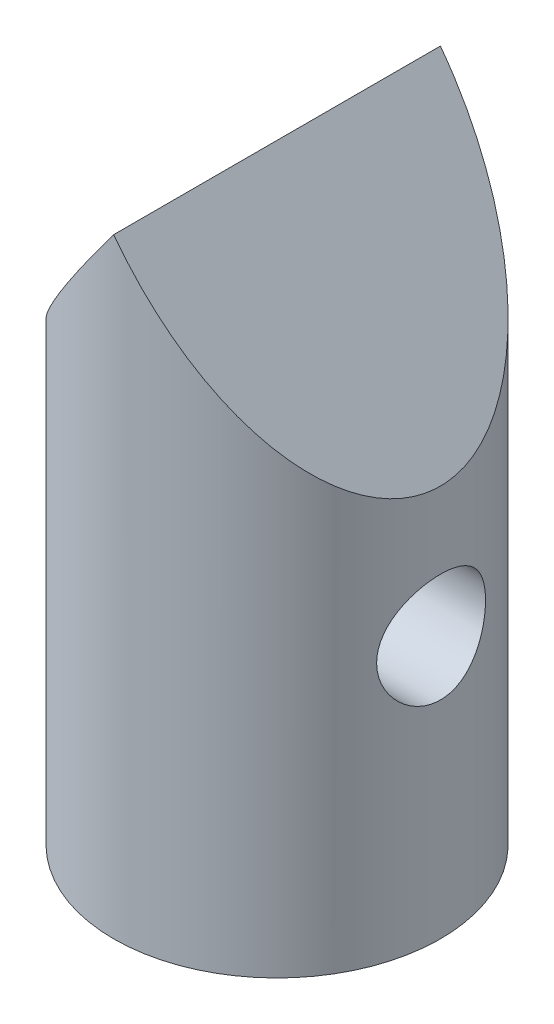
ISO-10303-21;
HEADER;
FILE_DESCRIPTION(('STEP AP214'),'2;1');
FILE_NAME('part.step','',(''),(''),'','','');
FILE_SCHEMA(('AUTOMOTIVE_DESIGN { 1 0 10303 214 1 1 1 1 }'));
ENDSEC;
DATA;
#1=APPLICATION_CONTEXT('core data for automotive mechanical design processes');
#2=APPLICATION_PROTOCOL_DEFINITION('international standard','automotive_design',2000,#1);
#3=PRODUCT_CONTEXT('',#1,'mechanical');
#4=PRODUCT('Part','Part','',(#3));
#5=PRODUCT_RELATED_PRODUCT_CATEGORY('part','',(#4));
#6=PRODUCT_DEFINITION_FORMATION('','',#4);
#7=PRODUCT_DEFINITION_CONTEXT('part definition',#1,'design');
#8=PRODUCT_DEFINITION('design','',#6,#7);
#9=PRODUCT_DEFINITION_SHAPE('','',#8);
#10=(LENGTH_UNIT() NAMED_UNIT(*) SI_UNIT(.MILLI.,.METRE.));
#11=(NAMED_UNIT(*) PLANE_ANGLE_UNIT() SI_UNIT($,.RADIAN.));
#12=(NAMED_UNIT(*) SI_UNIT($,.STERADIAN.) SOLID_ANGLE_UNIT());
#13=UNCERTAINTY_MEASURE_WITH_UNIT(LENGTH_MEASURE(1.E-05),#10,'distance_accuracy_value','');
#14=(GEOMETRIC_REPRESENTATION_CONTEXT(3) GLOBAL_UNCERTAINTY_ASSIGNED_CONTEXT((#13)) GLOBAL_UNIT_ASSIGNED_CONTEXT((#10,
#11,#12)) REPRESENTATION_CONTEXT('',''));
#15=CARTESIAN_POINT('',(0.,0.,0.));
#16=DIRECTION('',(0.,0.,1.));
#17=DIRECTION('',(1.,0.,0.));
#18=AXIS2_PLACEMENT_3D('',#15,#16,#17);
#19=CARTESIAN_POINT('',(0.,17.78,0.));
#20=DIRECTION('',(0.,-1.,0.));
#21=DIRECTION('',(0.,0.,-1.));
#22=AXIS2_PLACEMENT_3D('',#19,#20,#21);
#23=CYLINDRICAL_SURFACE('',#22,4.7625);
#24=CARTESIAN_POINT('',(0.,0.,0.));
#25=DIRECTION('',(0.,1.,0.));
#26=DIRECTION('',(0.,0.,1.));
#27=AXIS2_PLACEMENT_3D('',#24,#25,#26);
#28=CIRCLE('',#27,4.7625);
#29=CARTESIAN_POINT('',(0.,0.,4.7625));
#30=VERTEX_POINT('',#29);
#31=EDGE_CURVE('E45',#30,#30,#28,.T.);
#32=ORIENTED_EDGE('',*,*,#31,.T.);
#33=EDGE_LOOP('',(#32));
#34=FACE_BOUND('',#33,.T.);
#35=CARTESIAN_POINT('',(0.,17.78,0.));
#36=DIRECTION('',(0.8,0.6,0.));
#37=DIRECTION('',(0.6,-0.8,0.));
#38=AXIS2_PLACEMENT_3D('',#35,#36,#37);
#39=ELLIPSE('',#38,7.9375,4.7625);
#40=CARTESIAN_POINT('',(0.,17.78,4.7625));
#41=VERTEX_POINT('',#40);
#42=CARTESIAN_POINT('',(0.,17.78,-4.7625));
#43=VERTEX_POINT('',#42);
#44=EDGE_CURVE('E51',#41,#43,#39,.T.);
#45=ORIENTED_EDGE('',*,*,#44,.F.);
#46=CARTESIAN_POINT('',(0.,17.78,0.));
#47=DIRECTION('',(-0.8,0.6,0.));
#48=DIRECTION('',(-0.6,-0.8,0.));
#49=AXIS2_PLACEMENT_3D('',#46,#47,#48);
#50=ELLIPSE('',#49,7.9375,4.7625);
#51=EDGE_CURVE('E56',#43,#41,#50,.T.);
#52=ORIENTED_EDGE('',*,*,#51,.F.);
#53=EDGE_LOOP('',(#45,#52));
#54=FACE_BOUND('',#53,.T.);
#55=CARTESIAN_POINT('',(-4.49012806053458,7.62,1.5875));
#56=CARTESIAN_POINT('',(-4.49012777567064,7.70646822755226,1.58750040949199));
#57=CARTESIAN_POINT('',(-4.49265308749236,7.79293399471995,1.58041146910077));
#58=CARTESIAN_POINT('',(-4.50242898853992,7.96330389332837,1.55233867155598));
#59=CARTESIAN_POINT('',(-4.50968035613225,8.04720760042254,1.53135252556733));
#60=CARTESIAN_POINT('',(-4.52799773355957,8.20995769263319,1.47630433352479));
#61=CARTESIAN_POINT('',(-4.53905626304473,8.28881363799031,1.44226791397765));
#62=CARTESIAN_POINT('',(-4.5637310619139,8.43972157706989,1.36217283515069));
#63=CARTESIAN_POINT('',(-4.57734789544485,8.51177206480389,1.31611152331554));
#64=CARTESIAN_POINT('',(-4.60620251934364,8.64984294021207,1.21134369497807));
#65=CARTESIAN_POINT('',(-4.62148070565872,8.71555824301637,1.15224614193745));
#66=CARTESIAN_POINT('',(-4.65159510371592,8.83635329694411,1.02391792170285));
#67=CARTESIAN_POINT('',(-4.66643124415977,8.89143134013701,0.954685630395646));
#68=CARTESIAN_POINT('',(-4.69445763738356,8.99077274951073,0.805822156394453));
#69=CARTESIAN_POINT('',(-4.70759484726299,9.03471645335601,0.725966784068934));
#70=CARTESIAN_POINT('',(-4.73026718998935,9.10842664138992,0.559484566492615));
#71=CARTESIAN_POINT('',(-4.73980329347265,9.13819694641834,0.472859553528449));
#72=CARTESIAN_POINT('',(-4.75391282248152,9.18168066922892,0.298495747675672));
#73=CARTESIAN_POINT('',(-4.75864737209377,9.195916720933,0.210900573329086));
#74=CARTESIAN_POINT('',(-4.76319228046466,9.20958961571005,0.034445376283244));
#75=CARTESIAN_POINT('',(-4.76300390842339,9.20903027324821,-0.0544143145009298));
#76=CARTESIAN_POINT('',(-4.75783337894744,9.19345974587642,-0.227176830370185));
#77=CARTESIAN_POINT('',(-4.75303952798777,9.17901623604672,-0.311137377139271));
#78=CARTESIAN_POINT('',(-4.73943310651795,9.13702614269353,-0.475366459130179));
#79=CARTESIAN_POINT('',(-4.73062026364395,9.10947867111964,-0.555634743724441));
#80=CARTESIAN_POINT('',(-4.70972626590601,9.04173115877652,-0.711442053811696));
#81=CARTESIAN_POINT('',(-4.69760367507278,9.00136957255699,-0.786905050788285));
#82=CARTESIAN_POINT('',(-4.67135198948881,8.90927271760068,-0.930154866774382));
#83=CARTESIAN_POINT('',(-4.65722233718322,8.85753428621896,-0.997939543335821));
#84=CARTESIAN_POINT('',(-4.62766079563288,8.74129190038108,-1.12728512565115));
#85=CARTESIAN_POINT('',(-4.61219891586608,8.67630161192036,-1.18840274934474));
#86=CARTESIAN_POINT('',(-4.58227644701614,8.53686264791528,-1.29901514960847));
#87=CARTESIAN_POINT('',(-4.56781601248676,8.46241251743024,-1.34850813494589));
#88=CARTESIAN_POINT('',(-4.54136958652655,8.30476236933553,-1.43508008488034));
#89=CARTESIAN_POINT('',(-4.52942181075379,8.2214527414536,-1.47197201104604));
#90=CARTESIAN_POINT('',(-4.509796207693,8.04930541160231,-1.53105356936297));
#91=CARTESIAN_POINT('',(-4.50211659108192,7.96047004356035,-1.5532493632619));
#92=CARTESIAN_POINT('',(-4.49230172629537,7.78408661080152,-1.58140603531863));
#93=CARTESIAN_POINT('',(-4.48993197000283,7.69666128821616,-1.58805418911537));
#94=CARTESIAN_POINT('',(-4.49034966899696,7.5219303632767,-1.58687363427217));
#95=CARTESIAN_POINT('',(-4.49313618758519,7.43462474206069,-1.57904755504828));
#96=CARTESIAN_POINT('',(-4.50331868716889,7.26573831693353,-1.54975822183853));
#97=CARTESIAN_POINT('',(-4.51055304136942,7.18406387963586,-1.52877265044413));
#98=CARTESIAN_POINT('',(-4.52863828953141,7.02541202509498,-1.47433325681495));
#99=CARTESIAN_POINT('',(-4.53948982459164,6.94843544334955,-1.44087722422699));
#100=CARTESIAN_POINT('',(-4.56401293183202,6.79865858190548,-1.36124051592301));
#101=CARTESIAN_POINT('',(-4.57776303244155,6.72606820480616,-1.3146899003941));
#102=CARTESIAN_POINT('',(-4.60638157860437,6.58948064184082,-1.21060468851014));
#103=CARTESIAN_POINT('',(-4.62125035304532,6.52548599862531,-1.15306685422932));
#104=CARTESIAN_POINT('',(-4.65129623837577,6.40472432525612,-1.02535308311676));
#105=CARTESIAN_POINT('',(-4.66645376679908,6.34845315584508,-0.95470229199281));
#106=CARTESIAN_POINT('',(-4.69466376935812,6.24853312402248,-0.80458832509791));
#107=CARTESIAN_POINT('',(-4.70771631825591,6.20488381327965,-0.725125462472478));
#108=CARTESIAN_POINT('',(-4.73018494224332,6.13184558353203,-0.56003803161127));
#109=CARTESIAN_POINT('',(-4.73962460132193,6.10236384752745,-0.4744579082724));
#110=CARTESIAN_POINT('',(-4.75390544704967,6.05833220947958,-0.299177814530552));
#111=CARTESIAN_POINT('',(-4.75874829354005,6.0437769175647,-0.2094793434768));
#112=CARTESIAN_POINT('',(-4.76316457887557,6.03049645180104,-0.033044345677816));
#113=CARTESIAN_POINT('',(-4.76297498141985,6.03105941688235,0.0536332492230283));
#114=CARTESIAN_POINT('',(-4.75793111974544,6.04624347668242,0.225601442687775));
#115=CARTESIAN_POINT('',(-4.75307723394552,6.06086343094252,0.310892153200252));
#116=CARTESIAN_POINT('',(-4.7393370249013,6.10327429738934,0.476316864598393));
#117=CARTESIAN_POINT('',(-4.73051597648323,6.13085231687278,0.556511255074052));
#118=CARTESIAN_POINT('',(-4.70974992618386,6.19819933061673,0.711165632116924));
#119=CARTESIAN_POINT('',(-4.69780435926226,6.23797053012526,0.78562457832611));
#120=CARTESIAN_POINT('',(-4.67147066764261,6.33026660046194,0.929694000890196));
#121=CARTESIAN_POINT('',(-4.65700860080933,6.38320841304335,0.999023674347701));
#122=CARTESIAN_POINT('',(-4.62745119707109,6.49963360846046,1.12804737920748));
#123=CARTESIAN_POINT('',(-4.61235565927292,6.56312035459208,1.18773832432904));
#124=CARTESIAN_POINT('',(-4.58252956723137,6.70180485199428,1.29816512152257));
#125=CARTESIAN_POINT('',(-4.56783643181951,6.77736374867541,1.34845895852167));
#126=CARTESIAN_POINT('',(-4.54120556900287,6.93631840270816,1.43559901999052));
#127=CARTESIAN_POINT('',(-4.52926712193483,7.01971210518459,1.47244875820092));
#128=CARTESIAN_POINT('',(-4.51010868052842,7.18813939562481,1.53010207727411));
#129=CARTESIAN_POINT('',(-4.50269979660777,7.27292846834652,1.55155568077486));
#130=CARTESIAN_POINT('',(-4.49271046368985,7.44514648011589,1.58025198323696));
#131=CARTESIAN_POINT('',(-4.4901283485522,7.5325744976395,1.58749958597459));
#132=CARTESIAN_POINT('',(-4.49012806053458,7.62,1.5875));
#133=B_SPLINE_CURVE_WITH_KNOTS('',3,(#55,#56,#57,#58,#59,#60,#61,#62,#63,#64,#65,#66,#67,#68,
#69,#70,#71,#72,#73,#74,#75,#76,#77,#78,#79,#80,#81,#82,#83,#84,#85,#86,#87,#88,#89,#90,#91,#92,
#93,#94,#95,#96,#97,#98,#99,#100,#101,#102,#103,#104,#105,#106,#107,#108,#109,#110,#111,#112,
#113,#114,#115,#116,#117,#118,#119,#120,#121,#122,#123,#124,#125,#126,#127,#128,#129,#130,#131,
#132),.UNSPECIFIED.,.T.,.F.,(4,2,2,2,2,2,2,2,2,2,2,2,2,2,2,2,2,2,2,2,2,2,2,2,2,2,2,2,2,2,2,2,2,
2,2,2,2,2,4),(0.,0.259080928368978,0.518204537336572,0.776821896157563,1.03549635131939,
1.30335873166264,1.57126408460531,1.84615941003056,2.12098058764028,2.38623981039333,
2.65143064617445,2.90622045160591,3.16102752650413,3.41918377090782,3.6774118710001,
3.94779776802719,4.21822530134218,4.49250815749182,4.76667594024978,5.02847437537398,
5.29022525637959,5.54298478279283,5.79578913142127,6.05661186651798,6.31751158484978,
6.5909635796796,6.86440586023933,7.13603143511827,7.40755889265449,7.66632459422097,
7.92506930361878,8.17970417710533,8.43438513082998,8.69847637235357,8.96265200783153,
9.2371688308998,9.51161385495001,9.77365349304622,10.0356026616121),.UNSPECIFIED.);
#134=CARTESIAN_POINT('',(-4.49012806053458,7.62,1.5875));
#135=VERTEX_POINT('',#134);
#136=EDGE_CURVE('E65',#135,#135,#133,.T.);
#137=ORIENTED_EDGE('',*,*,#136,.F.);
#138=EDGE_LOOP('',(#137));
#139=FACE_BOUND('',#138,.T.);
#140=CARTESIAN_POINT('',(4.49012806053458,7.62,1.5875));
#141=CARTESIAN_POINT('',(4.49012777567064,7.53353177244774,1.58750040949199));
#142=CARTESIAN_POINT('',(4.49265308749236,7.44706600528005,1.58041146910077));
#143=CARTESIAN_POINT('',(4.50242898853992,7.27669610667163,1.55233867155598));
#144=CARTESIAN_POINT('',(4.50968035613225,7.19279239957745,1.53135252556733));
#145=CARTESIAN_POINT('',(4.52799773355957,7.0300423073668,1.47630433352479));
#146=CARTESIAN_POINT('',(4.53905626304473,6.95118636200969,1.44226791397765));
#147=CARTESIAN_POINT('',(4.5637310619139,6.80027842293011,1.36217283515069));
#148=CARTESIAN_POINT('',(4.57734789544485,6.72822793519611,1.31611152331554));
#149=CARTESIAN_POINT('',(4.60620251934364,6.59015705978793,1.21134369497807));
#150=CARTESIAN_POINT('',(4.62148070565872,6.52444175698363,1.15224614193745));
#151=CARTESIAN_POINT('',(4.65159510371592,6.40364670305588,1.02391792170285));
#152=CARTESIAN_POINT('',(4.66643124415977,6.34856865986299,0.954685630395647));
#153=CARTESIAN_POINT('',(4.69445763738356,6.24922725048927,0.805822156394454));
#154=CARTESIAN_POINT('',(4.70759484726299,6.20528354664399,0.725966784068934));
#155=CARTESIAN_POINT('',(4.73026718998935,6.13157335861008,0.559484566492615));
#156=CARTESIAN_POINT('',(4.73980329347265,6.10180305358166,0.47285955352845));
#157=CARTESIAN_POINT('',(4.75391282248152,6.05831933077108,0.298495747675673));
#158=CARTESIAN_POINT('',(4.75864737209377,6.044083279067,0.210900573329087));
#159=CARTESIAN_POINT('',(4.76319228046466,6.03041038428995,0.0344453762832442));
#160=CARTESIAN_POINT('',(4.76300390842339,6.03096972675179,-0.0544143145009297));
#161=CARTESIAN_POINT('',(4.75783337894744,6.04654025412358,-0.227176830370185));
#162=CARTESIAN_POINT('',(4.75303952798777,6.06098376395328,-0.311137377139271));
#163=CARTESIAN_POINT('',(4.73943310651795,6.10297385730647,-0.47536645913018));
#164=CARTESIAN_POINT('',(4.73062026364395,6.13052132888036,-0.55563474372444));
#165=CARTESIAN_POINT('',(4.70972626590601,6.19826884122348,-0.711442053811696));
#166=CARTESIAN_POINT('',(4.69760367507278,6.23863042744301,-0.786905050788284));
#167=CARTESIAN_POINT('',(4.67135198948881,6.33072728239932,-0.930154866774381));
#168=CARTESIAN_POINT('',(4.65722233718322,6.38246571378104,-0.997939543335821));
#169=CARTESIAN_POINT('',(4.62766079563288,6.49870809961892,-1.12728512565115));
#170=CARTESIAN_POINT('',(4.61219891586608,6.56369838807964,-1.18840274934474));
#171=CARTESIAN_POINT('',(4.58227644701614,6.70313735208472,-1.29901514960847));
#172=CARTESIAN_POINT('',(4.56781601248676,6.77758748256976,-1.34850813494589));
#173=CARTESIAN_POINT('',(4.54136958652655,6.93523763066447,-1.43508008488034));
#174=CARTESIAN_POINT('',(4.52942181075379,7.0185472585464,-1.47197201104604));
#175=CARTESIAN_POINT('',(4.509796207693,7.19069458839769,-1.53105356936297));
#176=CARTESIAN_POINT('',(4.50211659108192,7.27952995643964,-1.5532493632619));
#177=CARTESIAN_POINT('',(4.49230172629537,7.45591338919848,-1.58140603531863));
#178=CARTESIAN_POINT('',(4.48993197000283,7.54333871178384,-1.58805418911537));
#179=CARTESIAN_POINT('',(4.49034966899696,7.7180696367233,-1.58687363427217));
#180=CARTESIAN_POINT('',(4.49313618758519,7.80537525793931,-1.57904755504828));
#181=CARTESIAN_POINT('',(4.50331868716889,7.97426168306647,-1.54975822183853));
#182=CARTESIAN_POINT('',(4.51055304136942,8.05593612036414,-1.52877265044413));
#183=CARTESIAN_POINT('',(4.52863828953141,8.21458797490502,-1.47433325681495));
#184=CARTESIAN_POINT('',(4.53948982459164,8.29156455665045,-1.44087722422699));
#185=CARTESIAN_POINT('',(4.56401293183202,8.44134141809452,-1.361240515923));
#186=CARTESIAN_POINT('',(4.57776303244155,8.51393179519384,-1.3146899003941));
#187=CARTESIAN_POINT('',(4.60638157860437,8.65051935815918,-1.21060468851014));
#188=CARTESIAN_POINT('',(4.62125035304532,8.71451400137469,-1.15306685422932));
#189=CARTESIAN_POINT('',(4.65129623837577,8.83527567474388,-1.02535308311676));
#190=CARTESIAN_POINT('',(4.66645376679909,8.89154684415492,-0.954702291992809));
#191=CARTESIAN_POINT('',(4.69466376935812,8.99146687597752,-0.804588325097909));
#192=CARTESIAN_POINT('',(4.70771631825591,9.03511618672035,-0.725125462472477));
#193=CARTESIAN_POINT('',(4.73018494224332,9.10815441646797,-0.560038031611269));
#194=CARTESIAN_POINT('',(4.73962460132193,9.13763615247255,-0.474457908272399));
#195=CARTESIAN_POINT('',(4.75390544704967,9.18166779052042,-0.299177814530551));
#196=CARTESIAN_POINT('',(4.75874829354005,9.1962230824353,-0.209479343476799));
#197=CARTESIAN_POINT('',(4.76316457887557,9.20950354819896,-0.0330443456778151));
#198=CARTESIAN_POINT('',(4.76297498141985,9.20894058311765,0.0536332492230292));
#199=CARTESIAN_POINT('',(4.75793111974544,9.19375652331758,0.225601442687776));
#200=CARTESIAN_POINT('',(4.75307723394552,9.17913656905748,0.310892153200253));
#201=CARTESIAN_POINT('',(4.7393370249013,9.13672570261066,0.476316864598393));
#202=CARTESIAN_POINT('',(4.73051597648323,9.10914768312722,0.556511255074053));
#203=CARTESIAN_POINT('',(4.70974992618386,9.04180066938327,0.711165632116926));
#204=CARTESIAN_POINT('',(4.69780435926226,9.00202946987474,0.785624578326111));
#205=CARTESIAN_POINT('',(4.67147066764261,8.90973339953806,0.929694000890197));
#206=CARTESIAN_POINT('',(4.65700860080933,8.85679158695664,0.999023674347702));
#207=CARTESIAN_POINT('',(4.62745119707109,8.74036639153954,1.12804737920748));
#208=CARTESIAN_POINT('',(4.61235565927292,8.67687964540792,1.18773832432904));
#209=CARTESIAN_POINT('',(4.58252956723137,8.53819514800572,1.29816512152257));
#210=CARTESIAN_POINT('',(4.56783643181951,8.46263625132458,1.34845895852167));
#211=CARTESIAN_POINT('',(4.54120556900287,8.30368159729184,1.43559901999052));
#212=CARTESIAN_POINT('',(4.52926712193483,8.2202878948154,1.47244875820092));
#213=CARTESIAN_POINT('',(4.51010868052842,8.05186060437518,1.53010207727411));
#214=CARTESIAN_POINT('',(4.50269979660777,7.96707153165348,1.55155568077486));
#215=CARTESIAN_POINT('',(4.49271046368985,7.79485351988411,1.58025198323696));
#216=CARTESIAN_POINT('',(4.49012834855219,7.7074255023605,1.58749958597459));
#217=CARTESIAN_POINT('',(4.49012806053458,7.62,1.5875));
#218=B_SPLINE_CURVE_WITH_KNOTS('',3,(#140,#141,#142,#143,#144,#145,#146,#147,#148,#149,#150,
#151,#152,#153,#154,#155,#156,#157,#158,#159,#160,#161,#162,#163,#164,#165,#166,#167,#168,#169,
#170,#171,#172,#173,#174,#175,#176,#177,#178,#179,#180,#181,#182,#183,#184,#185,#186,#187,#188,
#189,#190,#191,#192,#193,#194,#195,#196,#197,#198,#199,#200,#201,#202,#203,#204,#205,#206,#207,
#208,#209,#210,#211,#212,#213,#214,#215,#216,#217),.UNSPECIFIED.,.T.,.F.,(4,2,2,2,2,2,2,2,2,2,2,
2,2,2,2,2,2,2,2,2,2,2,2,2,2,2,2,2,2,2,2,2,2,2,2,2,2,2,4),(0.,0.259080928368977,
0.518204537336572,0.776821896157563,1.03549635131939,1.30335873166264,1.57126408460531,
1.84615941003056,2.12098058764027,2.38623981039333,2.65143064617444,2.90622045160591,
3.16102752650413,3.41918377090782,3.6774118710001,3.94779776802719,4.21822530134218,
4.49250815749182,4.76667594024978,5.02847437537398,5.29022525637959,5.54298478279283,
5.79578913142127,6.05661186651798,6.31751158484978,6.5909635796796,6.86440586023933,
7.13603143511827,7.40755889265449,7.66632459422097,7.92506930361878,8.17970417710533,
8.43438513082998,8.69847637235357,8.96265200783153,9.2371688308998,9.51161385495001,
9.77365349304622,10.0356026616121),.UNSPECIFIED.);
#219=CARTESIAN_POINT('',(4.49012806053458,7.62,1.5875));
#220=VERTEX_POINT('',#219);
#221=EDGE_CURVE('E37',#220,#220,#218,.T.);
#222=ORIENTED_EDGE('',*,*,#221,.F.);
#223=EDGE_LOOP('',(#222));
#224=FACE_BOUND('',#223,.T.);
#225=ADVANCED_FACE('F33',(#34,#54,#139,#224),#23,.T.);
#226=CARTESIAN_POINT('',(0.,0.,0.));
#227=DIRECTION('',(0.,1.,0.));
#228=DIRECTION('',(0.,0.,1.));
#229=AXIS2_PLACEMENT_3D('',#226,#227,#228);
#230=PLANE('',#229);
#231=ORIENTED_EDGE('',*,*,#31,.F.);
#232=EDGE_LOOP('',(#231));
#233=FACE_BOUND('',#232,.T.);
#234=ADVANCED_FACE('F78',(#233),#230,.F.);
#235=CARTESIAN_POINT('',(0.,17.78,17.78));
#236=DIRECTION('',(-0.8,0.6,0.));
#237=DIRECTION('',(-0.6,-0.8,0.));
#238=AXIS2_PLACEMENT_3D('',#235,#236,#237);
#239=PLANE('',#238);
#240=ORIENTED_EDGE('',*,*,#51,.T.);
#241=DIRECTION('',(0.,0.,1.));
#242=VECTOR('',#241,1.);
#243=CARTESIAN_POINT('',(0.,17.78,0.));
#244=LINE('',#243,#242);
#245=EDGE_CURVE('E11',#43,#41,#244,.T.);
#246=ORIENTED_EDGE('',*,*,#245,.F.);
#247=EDGE_LOOP('',(#240,#246));
#248=FACE_BOUND('',#247,.T.);
#249=ADVANCED_FACE('F61',(#248),#239,.T.);
#250=CARTESIAN_POINT('',(4.7625,11.43,17.78));
#251=DIRECTION('',(0.8,0.6,0.));
#252=DIRECTION('',(-0.6,0.8,0.));
#253=AXIS2_PLACEMENT_3D('',#250,#251,#252);
#254=PLANE('',#253);
#255=ORIENTED_EDGE('',*,*,#44,.T.);
#256=ORIENTED_EDGE('',*,*,#245,.T.);
#257=EDGE_LOOP('',(#255,#256));
#258=FACE_BOUND('',#257,.T.);
#259=ADVANCED_FACE('F59',(#258),#254,.T.);
#260=CARTESIAN_POINT('',(17.78,7.62,0.));
#261=DIRECTION('',(-1.,0.,0.));
#262=DIRECTION('',(0.,0.,1.));
#263=AXIS2_PLACEMENT_3D('',#260,#261,#262);
#264=CYLINDRICAL_SURFACE('',#263,1.5875);
#265=ORIENTED_EDGE('',*,*,#136,.T.);
#266=EDGE_LOOP('',(#265));
#267=FACE_BOUND('',#266,.T.);
#268=ORIENTED_EDGE('',*,*,#221,.T.);
#269=EDGE_LOOP('',(#268));
#270=FACE_BOUND('',#269,.T.);
#271=ADVANCED_FACE('F69',(#267,#270),#264,.F.);
#272=CLOSED_SHELL('',(#225,#234,#249,#259,#271));
#273=MANIFOLD_SOLID_BREP('B2',#272);
#274=ADVANCED_BREP_SHAPE_REPRESENTATION('',(#18,#273),#14);
#275=SHAPE_DEFINITION_REPRESENTATION(#9,#274);
ENDSEC;
END-ISO-10303-21;
